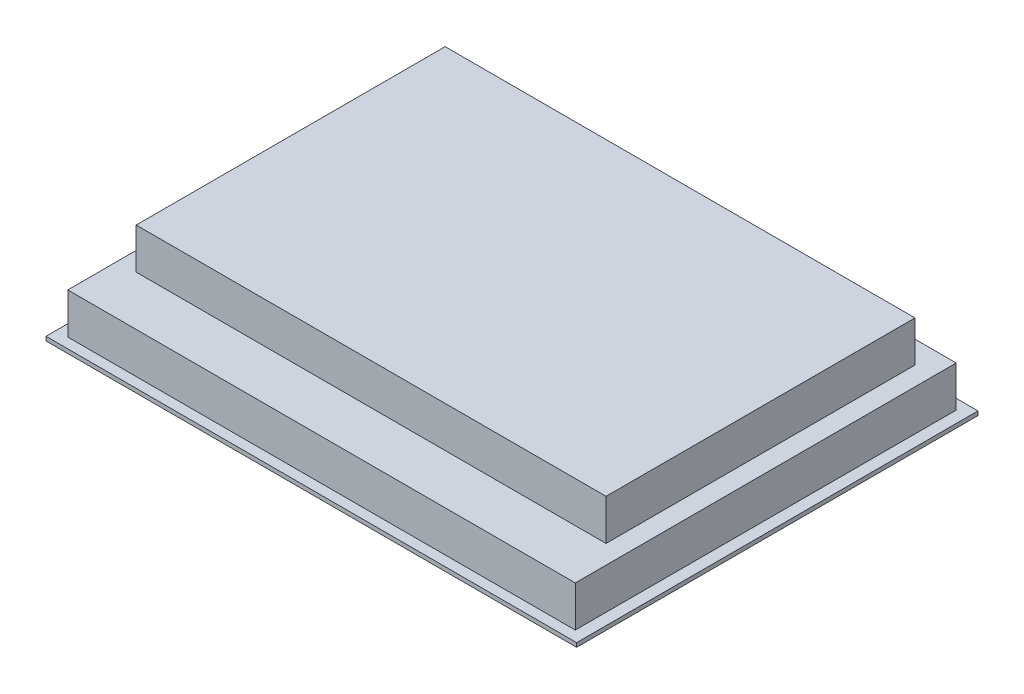
ISO-10303-21;
HEADER;
FILE_DESCRIPTION(('STEP AP214'),'2;1');
FILE_NAME('part.step','',(''),(''),'','','');
FILE_SCHEMA(('AUTOMOTIVE_DESIGN { 1 0 10303 214 1 1 1 1 }'));
ENDSEC;
DATA;
#1=APPLICATION_CONTEXT('core data for automotive mechanical design processes');
#2=APPLICATION_PROTOCOL_DEFINITION('international standard','automotive_design',2000,#1);
#3=PRODUCT_CONTEXT('',#1,'mechanical');
#4=PRODUCT('Part','Part','',(#3));
#5=PRODUCT_RELATED_PRODUCT_CATEGORY('part','',(#4));
#6=PRODUCT_DEFINITION_FORMATION('','',#4);
#7=PRODUCT_DEFINITION_CONTEXT('part definition',#1,'design');
#8=PRODUCT_DEFINITION('design','',#6,#7);
#9=PRODUCT_DEFINITION_SHAPE('','',#8);
#10=(LENGTH_UNIT() NAMED_UNIT(*) SI_UNIT(.MILLI.,.METRE.));
#11=(NAMED_UNIT(*) PLANE_ANGLE_UNIT() SI_UNIT($,.RADIAN.));
#12=(NAMED_UNIT(*) SI_UNIT($,.STERADIAN.) SOLID_ANGLE_UNIT());
#13=UNCERTAINTY_MEASURE_WITH_UNIT(LENGTH_MEASURE(1.E-05),#10,'distance_accuracy_value','');
#14=(GEOMETRIC_REPRESENTATION_CONTEXT(3) GLOBAL_UNCERTAINTY_ASSIGNED_CONTEXT((#13)) GLOBAL_UNIT_ASSIGNED_CONTEXT((#10,
#11,#12)) REPRESENTATION_CONTEXT('',''));
#15=CARTESIAN_POINT('',(0.,0.,0.));
#16=DIRECTION('',(0.,0.,1.));
#17=DIRECTION('',(1.,0.,0.));
#18=AXIS2_PLACEMENT_3D('',#15,#16,#17);
#19=CARTESIAN_POINT('',(195.,0.,-147.5));
#20=DIRECTION('',(0.,-1.,0.));
#21=DIRECTION('',(0.,0.,-1.));
#22=AXIS2_PLACEMENT_3D('',#19,#20,#21);
#23=PLANE('',#22);
#24=DIRECTION('',(0.,0.,-1.));
#25=VECTOR('',#24,1.);
#26=CARTESIAN_POINT('',(195.,0.,147.5));
#27=LINE('',#26,#25);
#28=CARTESIAN_POINT('',(195.,0.,147.5));
#29=VERTEX_POINT('',#28);
#30=CARTESIAN_POINT('',(195.,0.,-147.5));
#31=VERTEX_POINT('',#30);
#32=EDGE_CURVE('E245',#29,#31,#27,.T.);
#33=ORIENTED_EDGE('',*,*,#32,.F.);
#34=DIRECTION('',(1.,0.,0.));
#35=VECTOR('',#34,1.);
#36=CARTESIAN_POINT('',(-195.,0.,147.5));
#37=LINE('',#36,#35);
#38=CARTESIAN_POINT('',(-195.,0.,147.5));
#39=VERTEX_POINT('',#38);
#40=EDGE_CURVE('E250',#39,#29,#37,.T.);
#41=ORIENTED_EDGE('',*,*,#40,.F.);
#42=DIRECTION('',(0.,0.,1.));
#43=VECTOR('',#42,1.);
#44=CARTESIAN_POINT('',(-195.,0.,147.5));
#45=LINE('',#44,#43);
#46=CARTESIAN_POINT('',(-195.,0.,-147.5));
#47=VERTEX_POINT('',#46);
#48=EDGE_CURVE('E261',#47,#39,#45,.T.);
#49=ORIENTED_EDGE('',*,*,#48,.F.);
#50=DIRECTION('',(-1.,0.,0.));
#51=VECTOR('',#50,1.);
#52=CARTESIAN_POINT('',(-195.,0.,-147.5));
#53=LINE('',#52,#51);
#54=EDGE_CURVE('E259',#31,#47,#53,.T.);
#55=ORIENTED_EDGE('',*,*,#54,.F.);
#56=EDGE_LOOP('',(#33,#41,#49,#55));
#57=FACE_BOUND('',#56,.T.);
#58=DIRECTION('',(1.,0.,0.));
#59=VECTOR('',#58,1.);
#60=CARTESIAN_POINT('',(0.,0.,114.5));
#61=LINE('',#60,#59);
#62=CARTESIAN_POINT('',(-152.,0.,114.5));
#63=VERTEX_POINT('',#62);
#64=CARTESIAN_POINT('',(152.,0.,114.5));
#65=VERTEX_POINT('',#64);
#66=EDGE_CURVE('E176',#63,#65,#61,.T.);
#67=ORIENTED_EDGE('',*,*,#66,.T.);
#68=DIRECTION('',(0.,0.,-1.));
#69=VECTOR('',#68,1.);
#70=CARTESIAN_POINT('',(152.,0.,-380.49734020068));
#71=LINE('',#70,#69);
#72=CARTESIAN_POINT('',(152.,0.,-114.5));
#73=VERTEX_POINT('',#72);
#74=EDGE_CURVE('E48',#65,#73,#71,.T.);
#75=ORIENTED_EDGE('',*,*,#74,.T.);
#76=DIRECTION('',(1.,0.,0.));
#77=VECTOR('',#76,1.);
#78=CARTESIAN_POINT('',(0.,0.,-114.5));
#79=LINE('',#78,#77);
#80=CARTESIAN_POINT('',(-152.,0.,-114.5));
#81=VERTEX_POINT('',#80);
#82=EDGE_CURVE('E167',#81,#73,#79,.T.);
#83=ORIENTED_EDGE('',*,*,#82,.F.);
#84=DIRECTION('',(0.,0.,-1.));
#85=VECTOR('',#84,1.);
#86=CARTESIAN_POINT('',(-152.,0.,-380.49734020068));
#87=LINE('',#86,#85);
#88=EDGE_CURVE('E170',#63,#81,#87,.T.);
#89=ORIENTED_EDGE('',*,*,#88,.F.);
#90=EDGE_LOOP('',(#67,#75,#83,#89));
#91=FACE_BOUND('',#90,.T.);
#92=ADVANCED_FACE('F33',(#57,#91),#23,.T.);
#93=CARTESIAN_POINT('',(186.5,33.,140.));
#94=DIRECTION('',(0.,1.,0.));
#95=DIRECTION('',(0.,0.,1.));
#96=AXIS2_PLACEMENT_3D('',#93,#94,#95);
#97=PLANE('',#96);
#98=DIRECTION('',(0.,0.,-1.));
#99=VECTOR('',#98,1.);
#100=CARTESIAN_POINT('',(186.5,33.,-140.));
#101=LINE('',#100,#99);
#102=CARTESIAN_POINT('',(186.5,33.,140.));
#103=VERTEX_POINT('',#102);
#104=CARTESIAN_POINT('',(186.5,33.,-140.));
#105=VERTEX_POINT('',#104);
#106=EDGE_CURVE('E213',#103,#105,#101,.T.);
#107=ORIENTED_EDGE('',*,*,#106,.T.);
#108=DIRECTION('',(-1.,0.,0.));
#109=VECTOR('',#108,1.);
#110=CARTESIAN_POINT('',(-186.5,33.,-140.));
#111=LINE('',#110,#109);
#112=CARTESIAN_POINT('',(-186.5,33.,-140.));
#113=VERTEX_POINT('',#112);
#114=EDGE_CURVE('E216',#105,#113,#111,.T.);
#115=ORIENTED_EDGE('',*,*,#114,.T.);
#116=DIRECTION('',(0.,0.,1.));
#117=VECTOR('',#116,1.);
#118=CARTESIAN_POINT('',(-186.5,33.,-140.));
#119=LINE('',#118,#117);
#120=CARTESIAN_POINT('',(-186.5,33.,140.));
#121=VERTEX_POINT('',#120);
#122=EDGE_CURVE('E219',#113,#121,#119,.T.);
#123=ORIENTED_EDGE('',*,*,#122,.T.);
#124=DIRECTION('',(1.,0.,0.));
#125=VECTOR('',#124,1.);
#126=CARTESIAN_POINT('',(-186.5,33.,140.));
#127=LINE('',#126,#125);
#128=EDGE_CURVE('E221',#121,#103,#127,.T.);
#129=ORIENTED_EDGE('',*,*,#128,.T.);
#130=EDGE_LOOP('',(#107,#115,#123,#129));
#131=FACE_BOUND('',#130,.T.);
#132=DIRECTION('',(-1.,0.,0.));
#133=VECTOR('',#132,1.);
#134=CARTESIAN_POINT('',(-172.667635115209,33.,-123.521748103726));
#135=LINE('',#134,#133);
#136=CARTESIAN_POINT('',(172.667635115209,33.,-123.521748103726));
#137=VERTEX_POINT('',#136);
#138=CARTESIAN_POINT('',(-172.667635115209,33.,-123.521748103726));
#139=VERTEX_POINT('',#138);
#140=EDGE_CURVE('E199',#137,#139,#135,.T.);
#141=ORIENTED_EDGE('',*,*,#140,.F.);
#142=DIRECTION('',(0.,0.,-1.));
#143=VECTOR('',#142,1.);
#144=CARTESIAN_POINT('',(172.667635115209,33.,-123.521748103726));
#145=LINE('',#144,#143);
#146=CARTESIAN_POINT('',(172.667635115209,33.,103.548018623123));
#147=VERTEX_POINT('',#146);
#148=EDGE_CURVE('E182',#147,#137,#145,.T.);
#149=ORIENTED_EDGE('',*,*,#148,.F.);
#150=DIRECTION('',(1.,0.,0.));
#151=VECTOR('',#150,1.);
#152=CARTESIAN_POINT('',(-172.667635115209,33.,103.548018623123));
#153=LINE('',#152,#151);
#154=CARTESIAN_POINT('',(-172.667635115209,33.,103.548018623123));
#155=VERTEX_POINT('',#154);
#156=EDGE_CURVE('E190',#155,#147,#153,.T.);
#157=ORIENTED_EDGE('',*,*,#156,.F.);
#158=DIRECTION('',(0.,0.,1.));
#159=VECTOR('',#158,1.);
#160=CARTESIAN_POINT('',(-172.667635115209,33.,-123.521748103726));
#161=LINE('',#160,#159);
#162=EDGE_CURVE('E201',#139,#155,#161,.T.);
#163=ORIENTED_EDGE('',*,*,#162,.F.);
#164=EDGE_LOOP('',(#141,#149,#157,#163));
#165=FACE_BOUND('',#164,.T.);
#166=ADVANCED_FACE('F298',(#131,#165),#97,.T.);
#167=CARTESIAN_POINT('',(195.,3.,-147.5));
#168=DIRECTION('',(0.,-1.,0.));
#169=DIRECTION('',(0.,0.,-1.));
#170=AXIS2_PLACEMENT_3D('',#167,#168,#169);
#171=PLANE('',#170);
#172=DIRECTION('',(0.,0.,-1.));
#173=VECTOR('',#172,1.);
#174=CARTESIAN_POINT('',(195.,3.,147.5));
#175=LINE('',#174,#173);
#176=CARTESIAN_POINT('',(195.,3.,147.5));
#177=VERTEX_POINT('',#176);
#178=CARTESIAN_POINT('',(195.,3.,-147.5));
#179=VERTEX_POINT('',#178);
#180=EDGE_CURVE('E246',#177,#179,#175,.T.);
#181=ORIENTED_EDGE('',*,*,#180,.T.);
#182=DIRECTION('',(-1.,0.,0.));
#183=VECTOR('',#182,1.);
#184=CARTESIAN_POINT('',(-195.,3.,-147.5));
#185=LINE('',#184,#183);
#186=CARTESIAN_POINT('',(-195.,3.,-147.5));
#187=VERTEX_POINT('',#186);
#188=EDGE_CURVE('E249',#179,#187,#185,.T.);
#189=ORIENTED_EDGE('',*,*,#188,.T.);
#190=DIRECTION('',(0.,0.,1.));
#191=VECTOR('',#190,1.);
#192=CARTESIAN_POINT('',(-195.,3.,147.5));
#193=LINE('',#192,#191);
#194=CARTESIAN_POINT('',(-195.,3.,147.5));
#195=VERTEX_POINT('',#194);
#196=EDGE_CURVE('E252',#187,#195,#193,.T.);
#197=ORIENTED_EDGE('',*,*,#196,.T.);
#198=DIRECTION('',(1.,0.,0.));
#199=VECTOR('',#198,1.);
#200=CARTESIAN_POINT('',(-195.,3.,147.5));
#201=LINE('',#200,#199);
#202=EDGE_CURVE('E254',#195,#177,#201,.T.);
#203=ORIENTED_EDGE('',*,*,#202,.T.);
#204=EDGE_LOOP('',(#181,#189,#197,#203));
#205=FACE_BOUND('',#204,.T.);
#206=DIRECTION('',(0.,0.,-1.));
#207=VECTOR('',#206,1.);
#208=CARTESIAN_POINT('',(186.5,3.,-140.));
#209=LINE('',#208,#207);
#210=CARTESIAN_POINT('',(186.5,3.,140.));
#211=VERTEX_POINT('',#210);
#212=CARTESIAN_POINT('',(186.5,3.,-140.));
#213=VERTEX_POINT('',#212);
#214=EDGE_CURVE('E212',#211,#213,#209,.T.);
#215=ORIENTED_EDGE('',*,*,#214,.F.);
#216=DIRECTION('',(1.,0.,0.));
#217=VECTOR('',#216,1.);
#218=CARTESIAN_POINT('',(-186.5,3.,140.));
#219=LINE('',#218,#217);
#220=CARTESIAN_POINT('',(-186.5,3.,140.));
#221=VERTEX_POINT('',#220);
#222=EDGE_CURVE('E217',#221,#211,#219,.T.);
#223=ORIENTED_EDGE('',*,*,#222,.F.);
#224=DIRECTION('',(0.,0.,1.));
#225=VECTOR('',#224,1.);
#226=CARTESIAN_POINT('',(-186.5,3.,-140.));
#227=LINE('',#226,#225);
#228=CARTESIAN_POINT('',(-186.5,3.,-140.));
#229=VERTEX_POINT('',#228);
#230=EDGE_CURVE('E229',#229,#221,#227,.T.);
#231=ORIENTED_EDGE('',*,*,#230,.F.);
#232=DIRECTION('',(-1.,0.,0.));
#233=VECTOR('',#232,1.);
#234=CARTESIAN_POINT('',(-186.5,3.,-140.));
#235=LINE('',#234,#233);
#236=EDGE_CURVE('E226',#213,#229,#235,.T.);
#237=ORIENTED_EDGE('',*,*,#236,.F.);
#238=EDGE_LOOP('',(#215,#223,#231,#237));
#239=FACE_BOUND('',#238,.T.);
#240=ADVANCED_FACE('F288',(#205,#239),#171,.F.);
#241=CARTESIAN_POINT('',(195.,3.,147.5));
#242=DIRECTION('',(-1.,0.,0.));
#243=DIRECTION('',(0.,0.,1.));
#244=AXIS2_PLACEMENT_3D('',#241,#242,#243);
#245=PLANE('',#244);
#246=ORIENTED_EDGE('',*,*,#32,.T.);
#247=DIRECTION('',(0.,-1.,0.));
#248=VECTOR('',#247,1.);
#249=CARTESIAN_POINT('',(195.,3.,-147.5));
#250=LINE('',#249,#248);
#251=EDGE_CURVE('E11',#179,#31,#250,.T.);
#252=ORIENTED_EDGE('',*,*,#251,.F.);
#253=ORIENTED_EDGE('',*,*,#180,.F.);
#254=DIRECTION('',(0.,-1.,0.));
#255=VECTOR('',#254,1.);
#256=CARTESIAN_POINT('',(195.,3.,147.5));
#257=LINE('',#256,#255);
#258=EDGE_CURVE('E256',#177,#29,#257,.T.);
#259=ORIENTED_EDGE('',*,*,#258,.T.);
#260=EDGE_LOOP('',(#246,#252,#253,#259));
#261=FACE_BOUND('',#260,.T.);
#262=ADVANCED_FACE('F35',(#261),#245,.F.);
#263=CARTESIAN_POINT('',(-195.,3.,-147.5));
#264=DIRECTION('',(0.,0.,1.));
#265=DIRECTION('',(1.,0.,0.));
#266=AXIS2_PLACEMENT_3D('',#263,#264,#265);
#267=PLANE('',#266);
#268=ORIENTED_EDGE('',*,*,#54,.T.);
#269=DIRECTION('',(0.,-1.,0.));
#270=VECTOR('',#269,1.);
#271=CARTESIAN_POINT('',(-195.,3.,-147.5));
#272=LINE('',#271,#270);
#273=EDGE_CURVE('E41',#187,#47,#272,.T.);
#274=ORIENTED_EDGE('',*,*,#273,.F.);
#275=ORIENTED_EDGE('',*,*,#188,.F.);
#276=ORIENTED_EDGE('',*,*,#251,.T.);
#277=EDGE_LOOP('',(#268,#274,#275,#276));
#278=FACE_BOUND('',#277,.T.);
#279=ADVANCED_FACE('F290',(#278),#267,.F.);
#280=CARTESIAN_POINT('',(-195.,3.,147.5));
#281=DIRECTION('',(1.,0.,0.));
#282=DIRECTION('',(0.,0.,-1.));
#283=AXIS2_PLACEMENT_3D('',#280,#281,#282);
#284=PLANE('',#283);
#285=ORIENTED_EDGE('',*,*,#48,.T.);
#286=DIRECTION('',(0.,-1.,0.));
#287=VECTOR('',#286,1.);
#288=CARTESIAN_POINT('',(-195.,3.,147.5));
#289=LINE('',#288,#287);
#290=EDGE_CURVE('E266',#195,#39,#289,.T.);
#291=ORIENTED_EDGE('',*,*,#290,.F.);
#292=ORIENTED_EDGE('',*,*,#196,.F.);
#293=ORIENTED_EDGE('',*,*,#273,.T.);
#294=EDGE_LOOP('',(#285,#291,#292,#293));
#295=FACE_BOUND('',#294,.T.);
#296=ADVANCED_FACE('F273',(#295),#284,.F.);
#297=CARTESIAN_POINT('',(-195.,3.,147.5));
#298=DIRECTION('',(0.,0.,-1.));
#299=DIRECTION('',(-1.,0.,0.));
#300=AXIS2_PLACEMENT_3D('',#297,#298,#299);
#301=PLANE('',#300);
#302=ORIENTED_EDGE('',*,*,#40,.T.);
#303=ORIENTED_EDGE('',*,*,#258,.F.);
#304=ORIENTED_EDGE('',*,*,#202,.F.);
#305=ORIENTED_EDGE('',*,*,#290,.T.);
#306=EDGE_LOOP('',(#302,#303,#304,#305));
#307=FACE_BOUND('',#306,.T.);
#308=ADVANCED_FACE('F282',(#307),#301,.F.);
#309=CARTESIAN_POINT('',(186.5,33.,-140.));
#310=DIRECTION('',(-1.,0.,0.));
#311=DIRECTION('',(0.,0.,1.));
#312=AXIS2_PLACEMENT_3D('',#309,#310,#311);
#313=PLANE('',#312);
#314=ORIENTED_EDGE('',*,*,#214,.T.);
#315=DIRECTION('',(0.,-1.,0.));
#316=VECTOR('',#315,1.);
#317=CARTESIAN_POINT('',(186.5,33.,-140.));
#318=LINE('',#317,#316);
#319=EDGE_CURVE('E242',#105,#213,#318,.T.);
#320=ORIENTED_EDGE('',*,*,#319,.F.);
#321=ORIENTED_EDGE('',*,*,#106,.F.);
#322=DIRECTION('',(0.,-1.,0.));
#323=VECTOR('',#322,1.);
#324=CARTESIAN_POINT('',(186.5,33.,140.));
#325=LINE('',#324,#323);
#326=EDGE_CURVE('E223',#103,#211,#325,.T.);
#327=ORIENTED_EDGE('',*,*,#326,.T.);
#328=EDGE_LOOP('',(#314,#320,#321,#327));
#329=FACE_BOUND('',#328,.T.);
#330=ADVANCED_FACE('F311',(#329),#313,.F.);
#331=CARTESIAN_POINT('',(-186.5,33.,-140.));
#332=DIRECTION('',(0.,0.,1.));
#333=DIRECTION('',(1.,0.,0.));
#334=AXIS2_PLACEMENT_3D('',#331,#332,#333);
#335=PLANE('',#334);
#336=ORIENTED_EDGE('',*,*,#236,.T.);
#337=DIRECTION('',(0.,-1.,0.));
#338=VECTOR('',#337,1.);
#339=CARTESIAN_POINT('',(-186.5,33.,-140.));
#340=LINE('',#339,#338);
#341=EDGE_CURVE('E239',#113,#229,#340,.T.);
#342=ORIENTED_EDGE('',*,*,#341,.F.);
#343=ORIENTED_EDGE('',*,*,#114,.F.);
#344=ORIENTED_EDGE('',*,*,#319,.T.);
#345=EDGE_LOOP('',(#336,#342,#343,#344));
#346=FACE_BOUND('',#345,.T.);
#347=ADVANCED_FACE('F315',(#346),#335,.F.);
#348=CARTESIAN_POINT('',(-186.5,33.,-140.));
#349=DIRECTION('',(1.,0.,0.));
#350=DIRECTION('',(0.,0.,-1.));
#351=AXIS2_PLACEMENT_3D('',#348,#349,#350);
#352=PLANE('',#351);
#353=ORIENTED_EDGE('',*,*,#230,.T.);
#354=DIRECTION('',(0.,-1.,0.));
#355=VECTOR('',#354,1.);
#356=CARTESIAN_POINT('',(-186.5,33.,140.));
#357=LINE('',#356,#355);
#358=EDGE_CURVE('E236',#121,#221,#357,.T.);
#359=ORIENTED_EDGE('',*,*,#358,.F.);
#360=ORIENTED_EDGE('',*,*,#122,.F.);
#361=ORIENTED_EDGE('',*,*,#341,.T.);
#362=EDGE_LOOP('',(#353,#359,#360,#361));
#363=FACE_BOUND('',#362,.T.);
#364=ADVANCED_FACE('F320',(#363),#352,.F.);
#365=CARTESIAN_POINT('',(-186.5,33.,140.));
#366=DIRECTION('',(0.,0.,-1.));
#367=DIRECTION('',(-1.,0.,0.));
#368=AXIS2_PLACEMENT_3D('',#365,#366,#367);
#369=PLANE('',#368);
#370=ORIENTED_EDGE('',*,*,#222,.T.);
#371=ORIENTED_EDGE('',*,*,#326,.F.);
#372=ORIENTED_EDGE('',*,*,#128,.F.);
#373=ORIENTED_EDGE('',*,*,#358,.T.);
#374=EDGE_LOOP('',(#370,#371,#372,#373));
#375=FACE_BOUND('',#374,.T.);
#376=ADVANCED_FACE('F326',(#375),#369,.F.);
#377=CARTESIAN_POINT('',(172.667635115209,63.,-123.521748103726));
#378=DIRECTION('',(-1.,0.,0.));
#379=DIRECTION('',(0.,0.,1.));
#380=AXIS2_PLACEMENT_3D('',#377,#378,#379);
#381=PLANE('',#380);
#382=ORIENTED_EDGE('',*,*,#148,.T.);
#383=DIRECTION('',(0.,-1.,0.));
#384=VECTOR('',#383,1.);
#385=CARTESIAN_POINT('',(172.667635115209,63.,-123.521748103726));
#386=LINE('',#385,#384);
#387=CARTESIAN_POINT('',(172.667635115209,63.,-123.521748103726));
#388=VERTEX_POINT('',#387);
#389=EDGE_CURVE('E210',#388,#137,#386,.T.);
#390=ORIENTED_EDGE('',*,*,#389,.F.);
#391=DIRECTION('',(0.,0.,-1.));
#392=VECTOR('',#391,1.);
#393=CARTESIAN_POINT('',(172.667635115209,63.,-123.521748103726));
#394=LINE('',#393,#392);
#395=CARTESIAN_POINT('',(172.667635115209,63.,103.548018623123));
#396=VERTEX_POINT('',#395);
#397=EDGE_CURVE('E186',#396,#388,#394,.T.);
#398=ORIENTED_EDGE('',*,*,#397,.F.);
#399=DIRECTION('',(0.,-1.,0.));
#400=VECTOR('',#399,1.);
#401=CARTESIAN_POINT('',(172.667635115209,63.,103.548018623123));
#402=LINE('',#401,#400);
#403=EDGE_CURVE('E196',#396,#147,#402,.T.);
#404=ORIENTED_EDGE('',*,*,#403,.T.);
#405=EDGE_LOOP('',(#382,#390,#398,#404));
#406=FACE_BOUND('',#405,.T.);
#407=ADVANCED_FACE('F329',(#406),#381,.F.);
#408=CARTESIAN_POINT('',(-172.667635115209,63.,-123.521748103726));
#409=DIRECTION('',(0.,0.,1.));
#410=DIRECTION('',(1.,0.,0.));
#411=AXIS2_PLACEMENT_3D('',#408,#409,#410);
#412=PLANE('',#411);
#413=ORIENTED_EDGE('',*,*,#140,.T.);
#414=DIRECTION('',(0.,-1.,0.));
#415=VECTOR('',#414,1.);
#416=CARTESIAN_POINT('',(-172.667635115209,63.,-123.521748103726));
#417=LINE('',#416,#415);
#418=CARTESIAN_POINT('',(-172.667635115209,63.,-123.521748103726));
#419=VERTEX_POINT('',#418);
#420=EDGE_CURVE('E207',#419,#139,#417,.T.);
#421=ORIENTED_EDGE('',*,*,#420,.F.);
#422=DIRECTION('',(-1.,0.,0.));
#423=VECTOR('',#422,1.);
#424=CARTESIAN_POINT('',(-172.667635115209,63.,-123.521748103726));
#425=LINE('',#424,#423);
#426=EDGE_CURVE('E189',#388,#419,#425,.T.);
#427=ORIENTED_EDGE('',*,*,#426,.F.);
#428=ORIENTED_EDGE('',*,*,#389,.T.);
#429=EDGE_LOOP('',(#413,#421,#427,#428));
#430=FACE_BOUND('',#429,.T.);
#431=ADVANCED_FACE('F334',(#430),#412,.F.);
#432=CARTESIAN_POINT('',(-172.667635115209,63.,-123.521748103726));
#433=DIRECTION('',(1.,0.,0.));
#434=DIRECTION('',(0.,0.,-1.));
#435=AXIS2_PLACEMENT_3D('',#432,#433,#434);
#436=PLANE('',#435);
#437=ORIENTED_EDGE('',*,*,#162,.T.);
#438=DIRECTION('',(0.,-1.,0.));
#439=VECTOR('',#438,1.);
#440=CARTESIAN_POINT('',(-172.667635115209,63.,103.548018623123));
#441=LINE('',#440,#439);
#442=CARTESIAN_POINT('',(-172.667635115209,63.,103.548018623123));
#443=VERTEX_POINT('',#442);
#444=EDGE_CURVE('E56',#443,#155,#441,.T.);
#445=ORIENTED_EDGE('',*,*,#444,.F.);
#446=DIRECTION('',(0.,0.,1.));
#447=VECTOR('',#446,1.);
#448=CARTESIAN_POINT('',(-172.667635115209,63.,-123.521748103726));
#449=LINE('',#448,#447);
#450=EDGE_CURVE('E192',#419,#443,#449,.T.);
#451=ORIENTED_EDGE('',*,*,#450,.F.);
#452=ORIENTED_EDGE('',*,*,#420,.T.);
#453=EDGE_LOOP('',(#437,#445,#451,#452));
#454=FACE_BOUND('',#453,.T.);
#455=ADVANCED_FACE('F338',(#454),#436,.F.);
#456=CARTESIAN_POINT('',(-172.667635115209,63.,103.548018623123));
#457=DIRECTION('',(0.,0.,-1.));
#458=DIRECTION('',(-1.,0.,0.));
#459=AXIS2_PLACEMENT_3D('',#456,#457,#458);
#460=PLANE('',#459);
#461=ORIENTED_EDGE('',*,*,#156,.T.);
#462=ORIENTED_EDGE('',*,*,#403,.F.);
#463=DIRECTION('',(1.,0.,0.));
#464=VECTOR('',#463,1.);
#465=CARTESIAN_POINT('',(-172.667635115209,63.,103.548018623123));
#466=LINE('',#465,#464);
#467=EDGE_CURVE('E194',#443,#396,#466,.T.);
#468=ORIENTED_EDGE('',*,*,#467,.F.);
#469=ORIENTED_EDGE('',*,*,#444,.T.);
#470=EDGE_LOOP('',(#461,#462,#468,#469));
#471=FACE_BOUND('',#470,.T.);
#472=ADVANCED_FACE('F342',(#471),#460,.F.);
#473=CARTESIAN_POINT('',(172.667635115209,63.,103.548018623123));
#474=DIRECTION('',(0.,1.,0.));
#475=DIRECTION('',(0.,0.,1.));
#476=AXIS2_PLACEMENT_3D('',#473,#474,#475);
#477=PLANE('',#476);
#478=ORIENTED_EDGE('',*,*,#397,.T.);
#479=ORIENTED_EDGE('',*,*,#426,.T.);
#480=ORIENTED_EDGE('',*,*,#450,.T.);
#481=ORIENTED_EDGE('',*,*,#467,.T.);
#482=EDGE_LOOP('',(#478,#479,#480,#481));
#483=FACE_BOUND('',#482,.T.);
#484=ADVANCED_FACE('F346',(#483),#477,.T.);
#485=CARTESIAN_POINT('',(152.,2.,-380.49734020068));
#486=DIRECTION('',(-1.,0.,0.));
#487=DIRECTION('',(0.,0.,1.));
#488=AXIS2_PLACEMENT_3D('',#485,#486,#487);
#489=PLANE('',#488);
#490=ORIENTED_EDGE('',*,*,#74,.F.);
#491=DIRECTION('',(0.,-1.,0.));
#492=VECTOR('',#491,1.);
#493=CARTESIAN_POINT('',(152.,2.,114.5));
#494=LINE('',#493,#492);
#495=CARTESIAN_POINT('',(152.,2.,114.5));
#496=VERTEX_POINT('',#495);
#497=EDGE_CURVE('E150',#496,#65,#494,.T.);
#498=ORIENTED_EDGE('',*,*,#497,.F.);
#499=DIRECTION('',(0.,0.,-1.));
#500=VECTOR('',#499,1.);
#501=CARTESIAN_POINT('',(152.,2.,-380.49734020068));
#502=LINE('',#501,#500);
#503=CARTESIAN_POINT('',(152.,2.,-114.5));
#504=VERTEX_POINT('',#503);
#505=EDGE_CURVE('E158',#496,#504,#502,.T.);
#506=ORIENTED_EDGE('',*,*,#505,.T.);
#507=DIRECTION('',(0.,-1.,0.));
#508=VECTOR('',#507,1.);
#509=CARTESIAN_POINT('',(152.,2.,-114.5));
#510=LINE('',#509,#508);
#511=EDGE_CURVE('E180',#504,#73,#510,.T.);
#512=ORIENTED_EDGE('',*,*,#511,.T.);
#513=EDGE_LOOP('',(#490,#498,#506,#512));
#514=FACE_BOUND('',#513,.T.);
#515=ADVANCED_FACE('F160',(#514),#489,.T.);
#516=CARTESIAN_POINT('',(0.,2.,-114.5));
#517=DIRECTION('',(0.,0.,-1.));
#518=DIRECTION('',(-1.,0.,0.));
#519=AXIS2_PLACEMENT_3D('',#516,#517,#518);
#520=PLANE('',#519);
#521=ORIENTED_EDGE('',*,*,#82,.T.);
#522=ORIENTED_EDGE('',*,*,#511,.F.);
#523=DIRECTION('',(1.,0.,0.));
#524=VECTOR('',#523,1.);
#525=CARTESIAN_POINT('',(0.,2.,-114.5));
#526=LINE('',#525,#524);
#527=CARTESIAN_POINT('',(-152.,2.,-114.5));
#528=VERTEX_POINT('',#527);
#529=EDGE_CURVE('E162',#528,#504,#526,.T.);
#530=ORIENTED_EDGE('',*,*,#529,.F.);
#531=DIRECTION('',(0.,-1.,0.));
#532=VECTOR('',#531,1.);
#533=CARTESIAN_POINT('',(-152.,2.,-114.5));
#534=LINE('',#533,#532);
#535=EDGE_CURVE('E183',#528,#81,#534,.T.);
#536=ORIENTED_EDGE('',*,*,#535,.T.);
#537=EDGE_LOOP('',(#521,#522,#530,#536));
#538=FACE_BOUND('',#537,.T.);
#539=ADVANCED_FACE('F352',(#538),#520,.F.);
#540=CARTESIAN_POINT('',(-152.,2.,-380.49734020068));
#541=DIRECTION('',(-1.,0.,0.));
#542=DIRECTION('',(0.,0.,1.));
#543=AXIS2_PLACEMENT_3D('',#540,#541,#542);
#544=PLANE('',#543);
#545=ORIENTED_EDGE('',*,*,#88,.T.);
#546=ORIENTED_EDGE('',*,*,#535,.F.);
#547=DIRECTION('',(0.,0.,-1.));
#548=VECTOR('',#547,1.);
#549=CARTESIAN_POINT('',(-152.,2.,-380.49734020068));
#550=LINE('',#549,#548);
#551=CARTESIAN_POINT('',(-152.,2.,114.5));
#552=VERTEX_POINT('',#551);
#553=EDGE_CURVE('E157',#552,#528,#550,.T.);
#554=ORIENTED_EDGE('',*,*,#553,.F.);
#555=DIRECTION('',(0.,-1.,0.));
#556=VECTOR('',#555,1.);
#557=CARTESIAN_POINT('',(-152.,2.,114.5));
#558=LINE('',#557,#556);
#559=EDGE_CURVE('E152',#552,#63,#558,.T.);
#560=ORIENTED_EDGE('',*,*,#559,.T.);
#561=EDGE_LOOP('',(#545,#546,#554,#560));
#562=FACE_BOUND('',#561,.T.);
#563=ADVANCED_FACE('F355',(#562),#544,.F.);
#564=CARTESIAN_POINT('',(0.,2.,114.5));
#565=DIRECTION('',(0.,0.,-1.));
#566=DIRECTION('',(-1.,0.,0.));
#567=AXIS2_PLACEMENT_3D('',#564,#565,#566);
#568=PLANE('',#567);
#569=ORIENTED_EDGE('',*,*,#66,.F.);
#570=ORIENTED_EDGE('',*,*,#559,.F.);
#571=DIRECTION('',(1.,0.,0.));
#572=VECTOR('',#571,1.);
#573=CARTESIAN_POINT('',(0.,2.,114.5));
#574=LINE('',#573,#572);
#575=EDGE_CURVE('E147',#552,#496,#574,.T.);
#576=ORIENTED_EDGE('',*,*,#575,.T.);
#577=ORIENTED_EDGE('',*,*,#497,.T.);
#578=EDGE_LOOP('',(#569,#570,#576,#577));
#579=FACE_BOUND('',#578,.T.);
#580=ADVANCED_FACE('F149',(#579),#568,.T.);
#581=CARTESIAN_POINT('',(0.,2.,-380.49734020068));
#582=DIRECTION('',(0.,-1.,0.));
#583=DIRECTION('',(0.,0.,-1.));
#584=AXIS2_PLACEMENT_3D('',#581,#582,#583);
#585=PLANE('',#584);
#586=ORIENTED_EDGE('',*,*,#505,.F.);
#587=ORIENTED_EDGE('',*,*,#575,.F.);
#588=ORIENTED_EDGE('',*,*,#553,.T.);
#589=ORIENTED_EDGE('',*,*,#529,.T.);
#590=EDGE_LOOP('',(#586,#587,#588,#589));
#591=FACE_BOUND('',#590,.T.);
#592=ADVANCED_FACE('F165',(#591),#585,.T.);
#593=CLOSED_SHELL('',(#92,#166,#240,#262,#279,#296,#308,#330,#347,#364,#376,#407,#431,#455,#472,
#484,#515,#539,#563,#580,#592));
#594=MANIFOLD_SOLID_BREP('B2',#593);
#595=ADVANCED_BREP_SHAPE_REPRESENTATION('',(#18,#594),#14);
#596=SHAPE_DEFINITION_REPRESENTATION(#9,#595);
ENDSEC;
END-ISO-10303-21;
